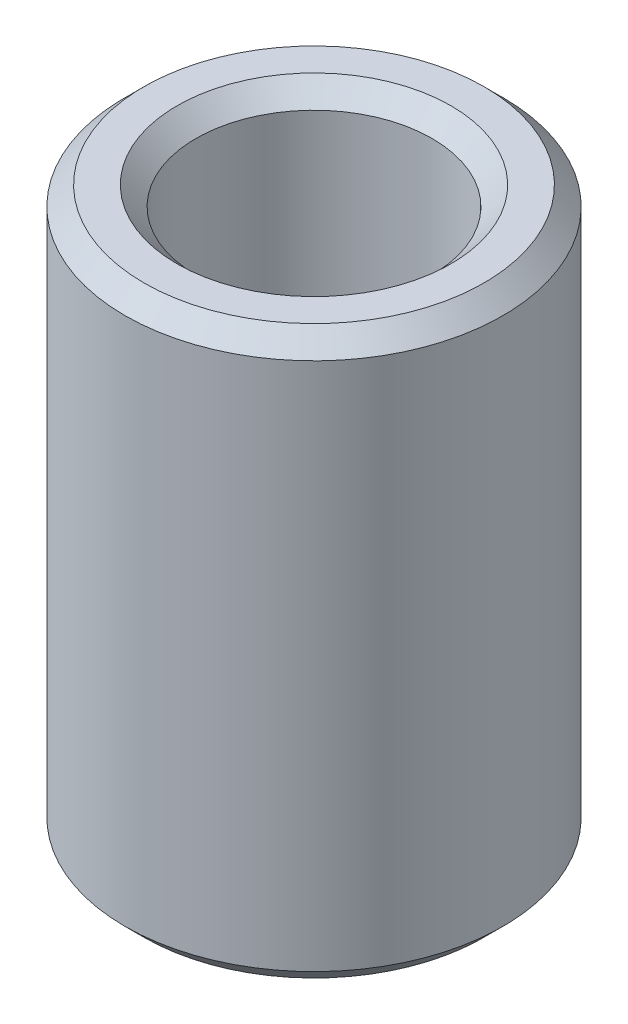
ISO-10303-21;
HEADER;
FILE_DESCRIPTION(('STEP AP214'),'2;1');
FILE_NAME('part.step','',(''),(''),'','','');
FILE_SCHEMA(('AUTOMOTIVE_DESIGN { 1 0 10303 214 1 1 1 1 }'));
ENDSEC;
DATA;
#1=APPLICATION_CONTEXT('core data for automotive mechanical design processes');
#2=APPLICATION_PROTOCOL_DEFINITION('international standard','automotive_design',2000,#1);
#3=PRODUCT_CONTEXT('',#1,'mechanical');
#4=PRODUCT('Part','Part','',(#3));
#5=PRODUCT_RELATED_PRODUCT_CATEGORY('part','',(#4));
#6=PRODUCT_DEFINITION_FORMATION('','',#4);
#7=PRODUCT_DEFINITION_CONTEXT('part definition',#1,'design');
#8=PRODUCT_DEFINITION('design','',#6,#7);
#9=PRODUCT_DEFINITION_SHAPE('','',#8);
#10=(LENGTH_UNIT() NAMED_UNIT(*) SI_UNIT(.MILLI.,.METRE.));
#11=(NAMED_UNIT(*) PLANE_ANGLE_UNIT() SI_UNIT($,.RADIAN.));
#12=(NAMED_UNIT(*) SI_UNIT($,.STERADIAN.) SOLID_ANGLE_UNIT());
#13=UNCERTAINTY_MEASURE_WITH_UNIT(LENGTH_MEASURE(1.E-05),#10,'distance_accuracy_value','');
#14=(GEOMETRIC_REPRESENTATION_CONTEXT(3) GLOBAL_UNCERTAINTY_ASSIGNED_CONTEXT((#13)) GLOBAL_UNIT_ASSIGNED_CONTEXT((#10,
#11,#12)) REPRESENTATION_CONTEXT('',''));
#15=CARTESIAN_POINT('',(0.,0.,0.));
#16=DIRECTION('',(0.,0.,1.));
#17=DIRECTION('',(1.,0.,0.));
#18=AXIS2_PLACEMENT_3D('',#15,#16,#17);
#19=CARTESIAN_POINT('',(0.,30.,0.));
#20=DIRECTION('',(0.,1.,0.));
#21=DIRECTION('',(0.,0.,1.));
#22=AXIS2_PLACEMENT_3D('',#19,#20,#21);
#23=PLANE('',#22);
#24=CARTESIAN_POINT('',(0.,30.,0.));
#25=DIRECTION('',(0.,1.,0.));
#26=DIRECTION('',(0.,0.,1.));
#27=AXIS2_PLACEMENT_3D('',#24,#25,#26);
#28=CIRCLE('',#27,14.5);
#29=CARTESIAN_POINT('',(0.,30.,14.5));
#30=VERTEX_POINT('',#29);
#31=EDGE_CURVE('E51',#30,#30,#28,.F.);
#32=ORIENTED_EDGE('',*,*,#31,.T.);
#33=EDGE_LOOP('',(#32));
#34=FACE_BOUND('',#33,.T.);
#35=CARTESIAN_POINT('',(0.,30.,0.));
#36=DIRECTION('',(0.,1.,0.));
#37=DIRECTION('',(0.,0.,1.));
#38=AXIS2_PLACEMENT_3D('',#35,#36,#37);
#39=CIRCLE('',#38,18.);
#40=CARTESIAN_POINT('',(0.,30.,18.));
#41=VERTEX_POINT('',#40);
#42=EDGE_CURVE('E60',#41,#41,#39,.T.);
#43=ORIENTED_EDGE('',*,*,#42,.T.);
#44=EDGE_LOOP('',(#43));
#45=FACE_BOUND('',#44,.T.);
#46=ADVANCED_FACE('F31',(#34,#45),#23,.T.);
#47=CARTESIAN_POINT('',(0.,-30.,0.));
#48=DIRECTION('',(0.,1.,0.));
#49=DIRECTION('',(0.,0.,1.));
#50=AXIS2_PLACEMENT_3D('',#47,#48,#49);
#51=PLANE('',#50);
#52=CARTESIAN_POINT('',(0.,-30.,0.));
#53=DIRECTION('',(0.,1.,0.));
#54=DIRECTION('',(0.,0.,1.));
#55=AXIS2_PLACEMENT_3D('',#52,#53,#54);
#56=CIRCLE('',#55,14.5);
#57=CARTESIAN_POINT('',(0.,-30.,14.5));
#58=VERTEX_POINT('',#57);
#59=EDGE_CURVE('E38',#58,#58,#56,.T.);
#60=ORIENTED_EDGE('',*,*,#59,.T.);
#61=EDGE_LOOP('',(#60));
#62=FACE_BOUND('',#61,.T.);
#63=CARTESIAN_POINT('',(0.,-30.,0.));
#64=DIRECTION('',(0.,1.,0.));
#65=DIRECTION('',(0.,0.,1.));
#66=AXIS2_PLACEMENT_3D('',#63,#64,#65);
#67=CIRCLE('',#66,18.);
#68=CARTESIAN_POINT('',(0.,-30.,18.));
#69=VERTEX_POINT('',#68);
#70=EDGE_CURVE('E42',#69,#69,#67,.F.);
#71=ORIENTED_EDGE('',*,*,#70,.T.);
#72=EDGE_LOOP('',(#71));
#73=FACE_BOUND('',#72,.T.);
#74=ADVANCED_FACE('F83',(#62,#73),#51,.F.);
#75=CARTESIAN_POINT('',(0.,30.,0.));
#76=DIRECTION('',(0.,-1.,0.));
#77=DIRECTION('',(0.,0.,-1.));
#78=AXIS2_PLACEMENT_3D('',#75,#76,#77);
#79=CYLINDRICAL_SURFACE('',#78,20.);
#80=CARTESIAN_POINT('',(0.,-28.,0.));
#81=DIRECTION('',(0.,1.,0.));
#82=DIRECTION('',(0.,0.,1.));
#83=AXIS2_PLACEMENT_3D('',#80,#81,#82);
#84=CIRCLE('',#83,20.);
#85=CARTESIAN_POINT('',(0.,-28.,20.));
#86=VERTEX_POINT('',#85);
#87=EDGE_CURVE('E46',#86,#86,#84,.T.);
#88=ORIENTED_EDGE('',*,*,#87,.T.);
#89=EDGE_LOOP('',(#88));
#90=FACE_BOUND('',#89,.T.);
#91=CARTESIAN_POINT('',(0.,28.,0.));
#92=DIRECTION('',(0.,1.,0.));
#93=DIRECTION('',(0.,0.,1.));
#94=AXIS2_PLACEMENT_3D('',#91,#92,#93);
#95=CIRCLE('',#94,20.);
#96=CARTESIAN_POINT('',(0.,28.,20.));
#97=VERTEX_POINT('',#96);
#98=EDGE_CURVE('E57',#97,#97,#95,.F.);
#99=ORIENTED_EDGE('',*,*,#98,.T.);
#100=EDGE_LOOP('',(#99));
#101=FACE_BOUND('',#100,.T.);
#102=ADVANCED_FACE('F78',(#90,#101),#79,.T.);
#103=CARTESIAN_POINT('',(0.,30.,0.));
#104=DIRECTION('',(0.,-1.,0.));
#105=DIRECTION('',(0.,0.,-1.));
#106=AXIS2_PLACEMENT_3D('',#103,#104,#105);
#107=CYLINDRICAL_SURFACE('',#106,12.5);
#108=CARTESIAN_POINT('',(0.,-28.,0.));
#109=DIRECTION('',(0.,1.,0.));
#110=DIRECTION('',(0.,0.,1.));
#111=AXIS2_PLACEMENT_3D('',#108,#109,#110);
#112=CIRCLE('',#111,12.5);
#113=CARTESIAN_POINT('',(0.,-28.,12.5));
#114=VERTEX_POINT('',#113);
#115=EDGE_CURVE('E10',#114,#114,#112,.F.);
#116=ORIENTED_EDGE('',*,*,#115,.T.);
#117=EDGE_LOOP('',(#116));
#118=FACE_BOUND('',#117,.T.);
#119=CARTESIAN_POINT('',(0.,28.,0.));
#120=DIRECTION('',(0.,1.,0.));
#121=DIRECTION('',(0.,0.,1.));
#122=AXIS2_PLACEMENT_3D('',#119,#120,#121);
#123=CIRCLE('',#122,12.5);
#124=CARTESIAN_POINT('',(0.,28.,12.5));
#125=VERTEX_POINT('',#124);
#126=EDGE_CURVE('E54',#125,#125,#123,.T.);
#127=ORIENTED_EDGE('',*,*,#126,.T.);
#128=EDGE_LOOP('',(#127));
#129=FACE_BOUND('',#128,.T.);
#130=ADVANCED_FACE('F68',(#118,#129),#107,.F.);
#131=CARTESIAN_POINT('',(0.,30.,0.));
#132=DIRECTION('',(0.,-1.,0.));
#133=DIRECTION('',(0.,0.,-1.));
#134=AXIS2_PLACEMENT_3D('',#131,#132,#133);
#135=CONICAL_SURFACE('',#134,18.,0.785398163397448);
#136=ORIENTED_EDGE('',*,*,#98,.F.);
#137=EDGE_LOOP('',(#136));
#138=FACE_BOUND('',#137,.T.);
#139=ORIENTED_EDGE('',*,*,#42,.F.);
#140=EDGE_LOOP('',(#139));
#141=FACE_BOUND('',#140,.T.);
#142=ADVANCED_FACE('F65',(#138,#141),#135,.T.);
#143=CARTESIAN_POINT('',(0.,28.,0.));
#144=DIRECTION('',(0.,1.,0.));
#145=DIRECTION('',(0.,0.,1.));
#146=AXIS2_PLACEMENT_3D('',#143,#144,#145);
#147=CONICAL_SURFACE('',#146,12.5,0.785398163397453);
#148=ORIENTED_EDGE('',*,*,#31,.F.);
#149=EDGE_LOOP('',(#148));
#150=FACE_BOUND('',#149,.T.);
#151=ORIENTED_EDGE('',*,*,#126,.F.);
#152=EDGE_LOOP('',(#151));
#153=FACE_BOUND('',#152,.T.);
#154=ADVANCED_FACE('F67',(#150,#153),#147,.F.);
#155=CARTESIAN_POINT('',(0.,-28.,0.));
#156=DIRECTION('',(0.,1.,0.));
#157=DIRECTION('',(0.,0.,1.));
#158=AXIS2_PLACEMENT_3D('',#155,#156,#157);
#159=CONICAL_SURFACE('',#158,20.,0.785398163397451);
#160=ORIENTED_EDGE('',*,*,#70,.F.);
#161=EDGE_LOOP('',(#160));
#162=FACE_BOUND('',#161,.T.);
#163=ORIENTED_EDGE('',*,*,#87,.F.);
#164=EDGE_LOOP('',(#163));
#165=FACE_BOUND('',#164,.T.);
#166=ADVANCED_FACE('F75',(#162,#165),#159,.T.);
#167=CARTESIAN_POINT('',(0.,-30.,0.));
#168=DIRECTION('',(0.,-1.,0.));
#169=DIRECTION('',(0.,0.,-1.));
#170=AXIS2_PLACEMENT_3D('',#167,#168,#169);
#171=CONICAL_SURFACE('',#170,14.5,0.785398163397447);
#172=ORIENTED_EDGE('',*,*,#115,.F.);
#173=EDGE_LOOP('',(#172));
#174=FACE_BOUND('',#173,.T.);
#175=ORIENTED_EDGE('',*,*,#59,.F.);
#176=EDGE_LOOP('',(#175));
#177=FACE_BOUND('',#176,.T.);
#178=ADVANCED_FACE('F33',(#174,#177),#171,.F.);
#179=CLOSED_SHELL('',(#46,#74,#102,#130,#142,#154,#166,#178));
#180=MANIFOLD_SOLID_BREP('B2',#179);
#181=ADVANCED_BREP_SHAPE_REPRESENTATION('',(#18,#180),#14);
#182=SHAPE_DEFINITION_REPRESENTATION(#9,#181);
ENDSEC;
END-ISO-10303-21;
